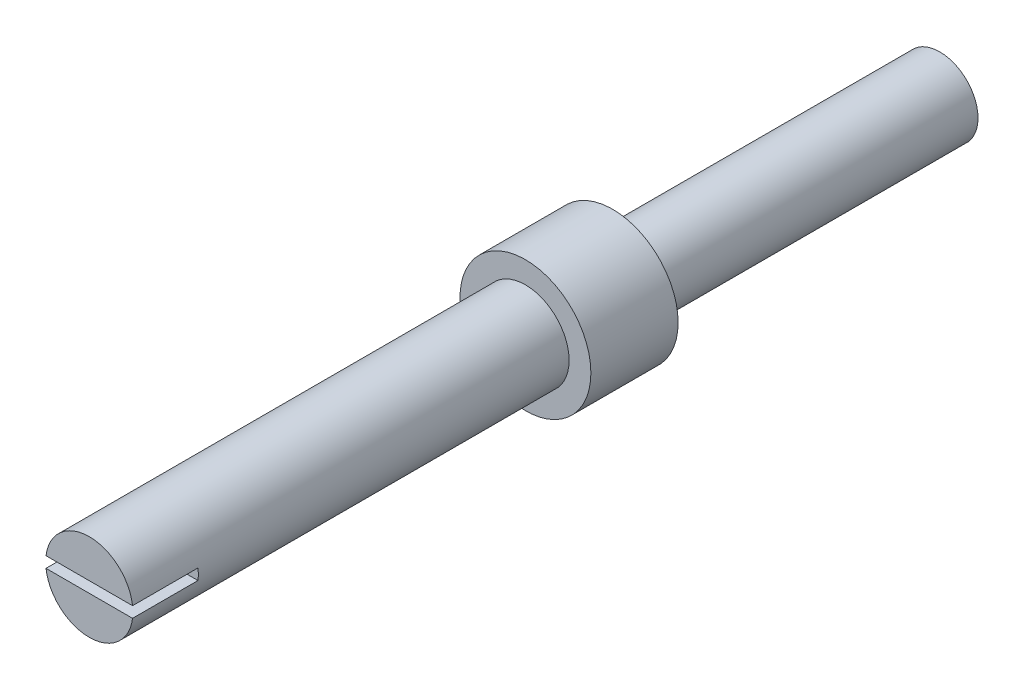
ISO-10303-21;
HEADER;
FILE_DESCRIPTION(('STEP AP214'),'2;1');
FILE_NAME('part.step','',(''),(''),'','','');
FILE_SCHEMA(('AUTOMOTIVE_DESIGN { 1 0 10303 214 1 1 1 1 }'));
ENDSEC;
DATA;
#1=APPLICATION_CONTEXT('core data for automotive mechanical design processes');
#2=APPLICATION_PROTOCOL_DEFINITION('international standard','automotive_design',2000,#1);
#3=PRODUCT_CONTEXT('',#1,'mechanical');
#4=PRODUCT('Part','Part','',(#3));
#5=PRODUCT_RELATED_PRODUCT_CATEGORY('part','',(#4));
#6=PRODUCT_DEFINITION_FORMATION('','',#4);
#7=PRODUCT_DEFINITION_CONTEXT('part definition',#1,'design');
#8=PRODUCT_DEFINITION('design','',#6,#7);
#9=PRODUCT_DEFINITION_SHAPE('','',#8);
#10=(LENGTH_UNIT() NAMED_UNIT(*) SI_UNIT(.MILLI.,.METRE.));
#11=(NAMED_UNIT(*) PLANE_ANGLE_UNIT() SI_UNIT($,.RADIAN.));
#12=(NAMED_UNIT(*) SI_UNIT($,.STERADIAN.) SOLID_ANGLE_UNIT());
#13=UNCERTAINTY_MEASURE_WITH_UNIT(LENGTH_MEASURE(1.E-05),#10,'distance_accuracy_value','');
#14=(GEOMETRIC_REPRESENTATION_CONTEXT(3) GLOBAL_UNCERTAINTY_ASSIGNED_CONTEXT((#13)) GLOBAL_UNIT_ASSIGNED_CONTEXT((#10,
#11,#12)) REPRESENTATION_CONTEXT('',''));
#15=CARTESIAN_POINT('',(0.,0.,0.));
#16=DIRECTION('',(0.,0.,1.));
#17=DIRECTION('',(1.,0.,0.));
#18=AXIS2_PLACEMENT_3D('',#15,#16,#17);
#19=CARTESIAN_POINT('',(0.,0.,24.));
#20=DIRECTION('',(0.,0.,1.));
#21=DIRECTION('',(1.,0.,0.));
#22=AXIS2_PLACEMENT_3D('',#19,#20,#21);
#23=PLANE('',#22);
#24=DIRECTION('',(-1.,0.,0.));
#25=VECTOR('',#24,1.);
#26=CARTESIAN_POINT('',(0.,0.25,24.));
#27=LINE('',#26,#25);
#28=CARTESIAN_POINT('',(1.98431348329844,0.25,24.));
#29=VERTEX_POINT('',#28);
#30=CARTESIAN_POINT('',(-1.98431348329844,0.25,24.));
#31=VERTEX_POINT('',#30);
#32=EDGE_CURVE('E79',#29,#31,#27,.T.);
#33=ORIENTED_EDGE('',*,*,#32,.F.);
#34=CARTESIAN_POINT('',(0.,0.,24.));
#35=DIRECTION('',(0.,0.,1.));
#36=DIRECTION('',(1.,0.,0.));
#37=AXIS2_PLACEMENT_3D('',#34,#35,#36);
#38=CIRCLE('',#37,2.);
#39=EDGE_CURVE('E92',#29,#31,#38,.T.);
#40=ORIENTED_EDGE('',*,*,#39,.T.);
#41=EDGE_LOOP('',(#33,#40));
#42=FACE_BOUND('',#41,.T.);
#43=ADVANCED_FACE('F32',(#42),#23,.T.);
#44=CARTESIAN_POINT('',(0.,0.,0.));
#45=DIRECTION('',(0.,0.,1.));
#46=DIRECTION('',(1.,0.,0.));
#47=AXIS2_PLACEMENT_3D('',#44,#45,#46);
#48=PLANE('',#47);
#49=CARTESIAN_POINT('',(0.,0.,0.));
#50=DIRECTION('',(0.,0.,1.));
#51=DIRECTION('',(1.,0.,0.));
#52=AXIS2_PLACEMENT_3D('',#49,#50,#51);
#53=CIRCLE('',#52,3.);
#54=CARTESIAN_POINT('',(3.,0.,0.));
#55=VERTEX_POINT('',#54);
#56=EDGE_CURVE('E96',#55,#55,#53,.T.);
#57=ORIENTED_EDGE('',*,*,#56,.F.);
#58=EDGE_LOOP('',(#57));
#59=FACE_BOUND('',#58,.T.);
#60=CARTESIAN_POINT('',(0.,0.,0.));
#61=DIRECTION('',(0.,0.,1.));
#62=DIRECTION('',(1.,0.,0.));
#63=AXIS2_PLACEMENT_3D('',#60,#61,#62);
#64=CIRCLE('',#63,1.75);
#65=CARTESIAN_POINT('',(1.75,0.,0.));
#66=VERTEX_POINT('',#65);
#67=EDGE_CURVE('E80',#66,#66,#64,.F.);
#68=ORIENTED_EDGE('',*,*,#67,.F.);
#69=EDGE_LOOP('',(#68));
#70=FACE_BOUND('',#69,.T.);
#71=ADVANCED_FACE('F123',(#59,#70),#48,.F.);
#72=CARTESIAN_POINT('',(0.,0.,4.));
#73=DIRECTION('',(0.,0.,1.));
#74=DIRECTION('',(1.,0.,0.));
#75=AXIS2_PLACEMENT_3D('',#72,#73,#74);
#76=PLANE('',#75);
#77=CARTESIAN_POINT('',(0.,0.,4.));
#78=DIRECTION('',(0.,0.,1.));
#79=DIRECTION('',(1.,0.,0.));
#80=AXIS2_PLACEMENT_3D('',#77,#78,#79);
#81=CIRCLE('',#80,3.);
#82=CARTESIAN_POINT('',(3.,0.,4.));
#83=VERTEX_POINT('',#82);
#84=EDGE_CURVE('E103',#83,#83,#81,.T.);
#85=ORIENTED_EDGE('',*,*,#84,.T.);
#86=EDGE_LOOP('',(#85));
#87=FACE_BOUND('',#86,.T.);
#88=CARTESIAN_POINT('',(0.,0.,4.));
#89=DIRECTION('',(0.,0.,1.));
#90=DIRECTION('',(1.,0.,0.));
#91=AXIS2_PLACEMENT_3D('',#88,#89,#90);
#92=CIRCLE('',#91,2.);
#93=CARTESIAN_POINT('',(2.,0.,4.));
#94=VERTEX_POINT('',#93);
#95=EDGE_CURVE('E93',#94,#94,#92,.T.);
#96=ORIENTED_EDGE('',*,*,#95,.F.);
#97=EDGE_LOOP('',(#96));
#98=FACE_BOUND('',#97,.T.);
#99=ADVANCED_FACE('F128',(#87,#98),#76,.T.);
#100=CARTESIAN_POINT('',(0.,0.,4.));
#101=DIRECTION('',(0.,0.,-1.));
#102=DIRECTION('',(-1.,0.,0.));
#103=AXIS2_PLACEMENT_3D('',#100,#101,#102);
#104=CYLINDRICAL_SURFACE('',#103,3.);
#105=ORIENTED_EDGE('',*,*,#84,.F.);
#106=EDGE_LOOP('',(#105));
#107=FACE_BOUND('',#106,.T.);
#108=ORIENTED_EDGE('',*,*,#56,.T.);
#109=EDGE_LOOP('',(#108));
#110=FACE_BOUND('',#109,.T.);
#111=ADVANCED_FACE('F34',(#107,#110),#104,.T.);
#112=CARTESIAN_POINT('',(0.,0.,24.));
#113=DIRECTION('',(0.,0.,-1.));
#114=DIRECTION('',(-1.,0.,0.));
#115=AXIS2_PLACEMENT_3D('',#112,#113,#114);
#116=CYLINDRICAL_SURFACE('',#115,2.);
#117=CARTESIAN_POINT('',(0.,0.,21.));
#118=DIRECTION('',(0.,0.,1.));
#119=DIRECTION('',(1.,0.,0.));
#120=AXIS2_PLACEMENT_3D('',#117,#118,#119);
#121=CIRCLE('',#120,2.);
#122=CARTESIAN_POINT('',(-1.98431348329844,0.25,21.));
#123=VERTEX_POINT('',#122);
#124=CARTESIAN_POINT('',(-1.98431348329844,-0.25,21.));
#125=VERTEX_POINT('',#124);
#126=EDGE_CURVE('E11',#123,#125,#121,.T.);
#127=ORIENTED_EDGE('',*,*,#126,.F.);
#128=DIRECTION('',(0.,0.,-1.));
#129=VECTOR('',#128,1.);
#130=CARTESIAN_POINT('',(-1.98431348329844,0.25,24.));
#131=LINE('',#130,#129);
#132=EDGE_CURVE('E55',#123,#31,#131,.F.);
#133=ORIENTED_EDGE('',*,*,#132,.T.);
#134=ORIENTED_EDGE('',*,*,#39,.F.);
#135=DIRECTION('',(0.,0.,-1.));
#136=VECTOR('',#135,1.);
#137=CARTESIAN_POINT('',(1.98431348329844,0.25,24.));
#138=LINE('',#137,#136);
#139=CARTESIAN_POINT('',(1.98431348329844,0.25,21.));
#140=VERTEX_POINT('',#139);
#141=EDGE_CURVE('E114',#29,#140,#138,.T.);
#142=ORIENTED_EDGE('',*,*,#141,.T.);
#143=CARTESIAN_POINT('',(1.98431348329844,-0.25,21.));
#144=VERTEX_POINT('',#143);
#145=EDGE_CURVE('E36',#144,#140,#121,.T.);
#146=ORIENTED_EDGE('',*,*,#145,.F.);
#147=DIRECTION('',(0.,0.,-1.));
#148=VECTOR('',#147,1.);
#149=CARTESIAN_POINT('',(1.98431348329844,-0.25,24.));
#150=LINE('',#149,#148);
#151=CARTESIAN_POINT('',(1.98431348329844,-0.25,24.));
#152=VERTEX_POINT('',#151);
#153=EDGE_CURVE('E74',#144,#152,#150,.F.);
#154=ORIENTED_EDGE('',*,*,#153,.T.);
#155=CARTESIAN_POINT('',(-1.98431348329844,-0.25,24.));
#156=VERTEX_POINT('',#155);
#157=EDGE_CURVE('E87',#156,#152,#38,.T.);
#158=ORIENTED_EDGE('',*,*,#157,.F.);
#159=DIRECTION('',(0.,0.,-1.));
#160=VECTOR('',#159,1.);
#161=CARTESIAN_POINT('',(-1.98431348329844,-0.25,24.));
#162=LINE('',#161,#160);
#163=EDGE_CURVE('E47',#156,#125,#162,.T.);
#164=ORIENTED_EDGE('',*,*,#163,.T.);
#165=EDGE_LOOP('',(#127,#133,#134,#142,#146,#154,#158,#164));
#166=FACE_BOUND('',#165,.T.);
#167=ORIENTED_EDGE('',*,*,#95,.T.);
#168=EDGE_LOOP('',(#167));
#169=FACE_BOUND('',#168,.T.);
#170=ADVANCED_FACE('F85',(#166,#169),#116,.T.);
#171=DIRECTION('',(1.,0.,0.));
#172=VECTOR('',#171,1.);
#173=CARTESIAN_POINT('',(0.,-0.25,24.));
#174=LINE('',#173,#172);
#175=EDGE_CURVE('E71',#156,#152,#174,.T.);
#176=ORIENTED_EDGE('',*,*,#175,.F.);
#177=ORIENTED_EDGE('',*,*,#157,.T.);
#178=EDGE_LOOP('',(#176,#177));
#179=FACE_BOUND('',#178,.T.);
#180=ADVANCED_FACE('F91',(#179),#23,.T.);
#181=CARTESIAN_POINT('',(0.,0.,-15.));
#182=DIRECTION('',(0.,0.,1.));
#183=DIRECTION('',(1.,0.,0.));
#184=AXIS2_PLACEMENT_3D('',#181,#182,#183);
#185=CYLINDRICAL_SURFACE('',#184,1.75);
#186=CARTESIAN_POINT('',(0.,0.,-15.));
#187=DIRECTION('',(0.,0.,-1.));
#188=DIRECTION('',(-1.,0.,0.));
#189=AXIS2_PLACEMENT_3D('',#186,#187,#188);
#190=CIRCLE('',#189,1.75);
#191=CARTESIAN_POINT('',(-1.75,0.,-15.));
#192=VERTEX_POINT('',#191);
#193=EDGE_CURVE('E98',#192,#192,#190,.T.);
#194=ORIENTED_EDGE('',*,*,#193,.F.);
#195=EDGE_LOOP('',(#194));
#196=FACE_BOUND('',#195,.T.);
#197=ORIENTED_EDGE('',*,*,#67,.T.);
#198=EDGE_LOOP('',(#197));
#199=FACE_BOUND('',#198,.T.);
#200=ADVANCED_FACE('F133',(#196,#199),#185,.T.);
#201=CARTESIAN_POINT('',(0.,0.,-15.));
#202=DIRECTION('',(0.,0.,-1.));
#203=DIRECTION('',(-1.,0.,0.));
#204=AXIS2_PLACEMENT_3D('',#201,#202,#203);
#205=PLANE('',#204);
#206=ORIENTED_EDGE('',*,*,#193,.T.);
#207=EDGE_LOOP('',(#206));
#208=FACE_BOUND('',#207,.T.);
#209=ADVANCED_FACE('F138',(#208),#205,.T.);
#210=CARTESIAN_POINT('',(0.,0.,21.));
#211=DIRECTION('',(0.,0.,1.));
#212=DIRECTION('',(1.,0.,0.));
#213=AXIS2_PLACEMENT_3D('',#210,#211,#212);
#214=PLANE('',#213);
#215=ORIENTED_EDGE('',*,*,#126,.T.);
#216=DIRECTION('',(1.,0.,0.));
#217=VECTOR('',#216,1.);
#218=CARTESIAN_POINT('',(-2.2422369999412,-0.25,21.));
#219=LINE('',#218,#217);
#220=EDGE_CURVE('E112',#125,#144,#219,.T.);
#221=ORIENTED_EDGE('',*,*,#220,.T.);
#222=ORIENTED_EDGE('',*,*,#145,.T.);
#223=DIRECTION('',(-1.,0.,0.));
#224=VECTOR('',#223,1.);
#225=CARTESIAN_POINT('',(-2.2422369999412,0.25,21.));
#226=LINE('',#225,#224);
#227=EDGE_CURVE('E89',#140,#123,#226,.T.);
#228=ORIENTED_EDGE('',*,*,#227,.T.);
#229=EDGE_LOOP('',(#215,#221,#222,#228));
#230=FACE_BOUND('',#229,.T.);
#231=ADVANCED_FACE('F111',(#230),#214,.T.);
#232=CARTESIAN_POINT('',(-2.2422369999412,0.25,21.));
#233=DIRECTION('',(0.,1.,0.));
#234=DIRECTION('',(0.,0.,1.));
#235=AXIS2_PLACEMENT_3D('',#232,#233,#234);
#236=PLANE('',#235);
#237=ORIENTED_EDGE('',*,*,#32,.T.);
#238=ORIENTED_EDGE('',*,*,#132,.F.);
#239=ORIENTED_EDGE('',*,*,#227,.F.);
#240=ORIENTED_EDGE('',*,*,#141,.F.);
#241=EDGE_LOOP('',(#237,#238,#239,#240));
#242=FACE_BOUND('',#241,.T.);
#243=ADVANCED_FACE('F113',(#242),#236,.F.);
#244=CARTESIAN_POINT('',(-2.2422369999412,-0.25,21.));
#245=DIRECTION('',(0.,-1.,0.));
#246=DIRECTION('',(0.,0.,-1.));
#247=AXIS2_PLACEMENT_3D('',#244,#245,#246);
#248=PLANE('',#247);
#249=ORIENTED_EDGE('',*,*,#175,.T.);
#250=ORIENTED_EDGE('',*,*,#153,.F.);
#251=ORIENTED_EDGE('',*,*,#220,.F.);
#252=ORIENTED_EDGE('',*,*,#163,.F.);
#253=EDGE_LOOP('',(#249,#250,#251,#252));
#254=FACE_BOUND('',#253,.T.);
#255=ADVANCED_FACE('F73',(#254),#248,.F.);
#256=CLOSED_SHELL('',(#43,#71,#99,#111,#170,#180,#200,#209,#231,#243,#255));
#257=MANIFOLD_SOLID_BREP('B2',#256);
#258=ADVANCED_BREP_SHAPE_REPRESENTATION('',(#18,#257),#14);
#259=SHAPE_DEFINITION_REPRESENTATION(#9,#258);
ENDSEC;
END-ISO-10303-21;
